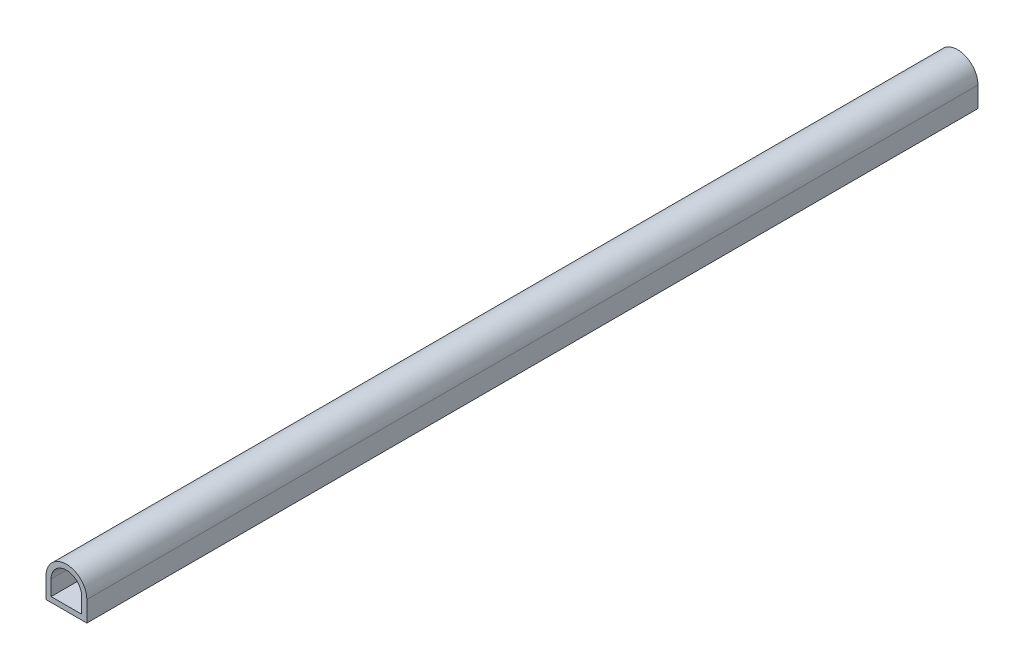
ISO-10303-21;
HEADER;
FILE_DESCRIPTION(('STEP AP214'),'2;1');
FILE_NAME('part.step','',(''),(''),'','','');
FILE_SCHEMA(('AUTOMOTIVE_DESIGN { 1 0 10303 214 1 1 1 1 }'));
ENDSEC;
DATA;
#1=APPLICATION_CONTEXT('core data for automotive mechanical design processes');
#2=APPLICATION_PROTOCOL_DEFINITION('international standard','automotive_design',2000,#1);
#3=PRODUCT_CONTEXT('',#1,'mechanical');
#4=PRODUCT('Part','Part','',(#3));
#5=PRODUCT_RELATED_PRODUCT_CATEGORY('part','',(#4));
#6=PRODUCT_DEFINITION_FORMATION('','',#4);
#7=PRODUCT_DEFINITION_CONTEXT('part definition',#1,'design');
#8=PRODUCT_DEFINITION('design','',#6,#7);
#9=PRODUCT_DEFINITION_SHAPE('','',#8);
#10=(LENGTH_UNIT() NAMED_UNIT(*) SI_UNIT(.MILLI.,.METRE.));
#11=(NAMED_UNIT(*) PLANE_ANGLE_UNIT() SI_UNIT($,.RADIAN.));
#12=(NAMED_UNIT(*) SI_UNIT($,.STERADIAN.) SOLID_ANGLE_UNIT());
#13=UNCERTAINTY_MEASURE_WITH_UNIT(LENGTH_MEASURE(1.E-05),#10,'distance_accuracy_value','');
#14=(GEOMETRIC_REPRESENTATION_CONTEXT(3) GLOBAL_UNCERTAINTY_ASSIGNED_CONTEXT((#13)) GLOBAL_UNIT_ASSIGNED_CONTEXT((#10,
#11,#12)) REPRESENTATION_CONTEXT('',''));
#15=CARTESIAN_POINT('',(0.,0.,0.));
#16=DIRECTION('',(0.,0.,1.));
#17=DIRECTION('',(1.,0.,0.));
#18=AXIS2_PLACEMENT_3D('',#15,#16,#17);
#19=CARTESIAN_POINT('',(0.,0.,131.));
#20=DIRECTION('',(0.,0.,1.));
#21=DIRECTION('',(1.,0.,0.));
#22=AXIS2_PLACEMENT_3D('',#19,#20,#21);
#23=PLANE('',#22);
#24=DIRECTION('',(0.,-1.,0.));
#25=VECTOR('',#24,1.);
#26=CARTESIAN_POINT('',(-3.,-3.,131.));
#27=LINE('',#26,#25);
#28=CARTESIAN_POINT('',(-3.,0.,131.));
#29=VERTEX_POINT('',#28);
#30=CARTESIAN_POINT('',(-3.,-3.,131.));
#31=VERTEX_POINT('',#30);
#32=EDGE_CURVE('E137',#29,#31,#27,.T.);
#33=ORIENTED_EDGE('',*,*,#32,.T.);
#34=DIRECTION('',(1.,0.,0.));
#35=VECTOR('',#34,1.);
#36=CARTESIAN_POINT('',(-3.,-3.,131.));
#37=LINE('',#36,#35);
#38=CARTESIAN_POINT('',(3.,-3.,131.));
#39=VERTEX_POINT('',#38);
#40=EDGE_CURVE('E140',#31,#39,#37,.T.);
#41=ORIENTED_EDGE('',*,*,#40,.T.);
#42=DIRECTION('',(0.,1.,0.));
#43=VECTOR('',#42,1.);
#44=CARTESIAN_POINT('',(3.,-3.,131.));
#45=LINE('',#44,#43);
#46=CARTESIAN_POINT('',(3.,0.,131.));
#47=VERTEX_POINT('',#46);
#48=EDGE_CURVE('E143',#39,#47,#45,.T.);
#49=ORIENTED_EDGE('',*,*,#48,.T.);
#50=CARTESIAN_POINT('',(0.,0.,131.));
#51=DIRECTION('',(0.,0.,1.));
#52=DIRECTION('',(1.,0.,0.));
#53=AXIS2_PLACEMENT_3D('',#50,#51,#52);
#54=CIRCLE('',#53,3.);
#55=EDGE_CURVE('E145',#47,#29,#54,.T.);
#56=ORIENTED_EDGE('',*,*,#55,.T.);
#57=EDGE_LOOP('',(#33,#41,#49,#56));
#58=FACE_BOUND('',#57,.T.);
#59=DIRECTION('',(1.,0.,0.));
#60=VECTOR('',#59,1.);
#61=CARTESIAN_POINT('',(-2.25,-2.25,131.));
#62=LINE('',#61,#60);
#63=CARTESIAN_POINT('',(-2.25,-2.25,131.));
#64=VERTEX_POINT('',#63);
#65=CARTESIAN_POINT('',(2.25,-2.25,131.));
#66=VERTEX_POINT('',#65);
#67=EDGE_CURVE('E109',#64,#66,#62,.T.);
#68=ORIENTED_EDGE('',*,*,#67,.F.);
#69=DIRECTION('',(0.,-1.,0.));
#70=VECTOR('',#69,1.);
#71=CARTESIAN_POINT('',(-2.25,-2.25,131.));
#72=LINE('',#71,#70);
#73=CARTESIAN_POINT('',(-2.25,0.,131.));
#74=VERTEX_POINT('',#73);
#75=EDGE_CURVE('E101',#74,#64,#72,.T.);
#76=ORIENTED_EDGE('',*,*,#75,.F.);
#77=CARTESIAN_POINT('',(0.,0.,131.));
#78=DIRECTION('',(0.,0.,1.));
#79=DIRECTION('',(1.,0.,0.));
#80=AXIS2_PLACEMENT_3D('',#77,#78,#79);
#81=CIRCLE('',#80,2.25);
#82=CARTESIAN_POINT('',(2.25,0.,131.));
#83=VERTEX_POINT('',#82);
#84=EDGE_CURVE('E123',#83,#74,#81,.T.);
#85=ORIENTED_EDGE('',*,*,#84,.F.);
#86=DIRECTION('',(0.,1.,0.));
#87=VECTOR('',#86,1.);
#88=CARTESIAN_POINT('',(2.25,-2.25,131.));
#89=LINE('',#88,#87);
#90=EDGE_CURVE('E121',#66,#83,#89,.T.);
#91=ORIENTED_EDGE('',*,*,#90,.F.);
#92=EDGE_LOOP('',(#68,#76,#85,#91));
#93=FACE_BOUND('',#92,.T.);
#94=ADVANCED_FACE('F36',(#58,#93),#23,.T.);
#95=CARTESIAN_POINT('',(0.,0.,0.));
#96=DIRECTION('',(0.,0.,1.));
#97=DIRECTION('',(1.,0.,0.));
#98=AXIS2_PLACEMENT_3D('',#95,#96,#97);
#99=PLANE('',#98);
#100=DIRECTION('',(0.,-1.,0.));
#101=VECTOR('',#100,1.);
#102=CARTESIAN_POINT('',(-3.,-3.,0.));
#103=LINE('',#102,#101);
#104=CARTESIAN_POINT('',(-3.,0.,0.));
#105=VERTEX_POINT('',#104);
#106=CARTESIAN_POINT('',(-3.,-3.,0.));
#107=VERTEX_POINT('',#106);
#108=EDGE_CURVE('E117',#105,#107,#103,.T.);
#109=ORIENTED_EDGE('',*,*,#108,.F.);
#110=CARTESIAN_POINT('',(0.,0.,0.));
#111=DIRECTION('',(0.,0.,1.));
#112=DIRECTION('',(1.,0.,0.));
#113=AXIS2_PLACEMENT_3D('',#110,#111,#112);
#114=CIRCLE('',#113,3.);
#115=CARTESIAN_POINT('',(3.,0.,0.));
#116=VERTEX_POINT('',#115);
#117=EDGE_CURVE('E141',#116,#105,#114,.T.);
#118=ORIENTED_EDGE('',*,*,#117,.F.);
#119=DIRECTION('',(0.,1.,0.));
#120=VECTOR('',#119,1.);
#121=CARTESIAN_POINT('',(3.,-3.,0.));
#122=LINE('',#121,#120);
#123=CARTESIAN_POINT('',(3.,-3.,0.));
#124=VERTEX_POINT('',#123);
#125=EDGE_CURVE('E152',#124,#116,#122,.T.);
#126=ORIENTED_EDGE('',*,*,#125,.F.);
#127=DIRECTION('',(1.,0.,0.));
#128=VECTOR('',#127,1.);
#129=CARTESIAN_POINT('',(-3.,-3.,0.));
#130=LINE('',#129,#128);
#131=EDGE_CURVE('E150',#107,#124,#130,.T.);
#132=ORIENTED_EDGE('',*,*,#131,.F.);
#133=EDGE_LOOP('',(#109,#118,#126,#132));
#134=FACE_BOUND('',#133,.T.);
#135=DIRECTION('',(0.,-1.,0.));
#136=VECTOR('',#135,1.);
#137=CARTESIAN_POINT('',(-2.25,-2.25,0.));
#138=LINE('',#137,#136);
#139=CARTESIAN_POINT('',(-2.25,0.,0.));
#140=VERTEX_POINT('',#139);
#141=CARTESIAN_POINT('',(-2.25,-2.25,0.));
#142=VERTEX_POINT('',#141);
#143=EDGE_CURVE('E59',#140,#142,#138,.T.);
#144=ORIENTED_EDGE('',*,*,#143,.T.);
#145=DIRECTION('',(1.,0.,0.));
#146=VECTOR('',#145,1.);
#147=CARTESIAN_POINT('',(-2.25,-2.25,0.));
#148=LINE('',#147,#146);
#149=CARTESIAN_POINT('',(2.25,-2.25,0.));
#150=VERTEX_POINT('',#149);
#151=EDGE_CURVE('E116',#142,#150,#148,.T.);
#152=ORIENTED_EDGE('',*,*,#151,.T.);
#153=DIRECTION('',(0.,1.,0.));
#154=VECTOR('',#153,1.);
#155=CARTESIAN_POINT('',(2.25,-2.25,0.));
#156=LINE('',#155,#154);
#157=CARTESIAN_POINT('',(2.25,0.,0.));
#158=VERTEX_POINT('',#157);
#159=EDGE_CURVE('E129',#150,#158,#156,.T.);
#160=ORIENTED_EDGE('',*,*,#159,.T.);
#161=CARTESIAN_POINT('',(0.,0.,0.));
#162=DIRECTION('',(0.,0.,1.));
#163=DIRECTION('',(1.,0.,0.));
#164=AXIS2_PLACEMENT_3D('',#161,#162,#163);
#165=CIRCLE('',#164,2.25);
#166=EDGE_CURVE('E110',#158,#140,#165,.T.);
#167=ORIENTED_EDGE('',*,*,#166,.T.);
#168=EDGE_LOOP('',(#144,#152,#160,#167));
#169=FACE_BOUND('',#168,.T.);
#170=ADVANCED_FACE('F170',(#134,#169),#99,.F.);
#171=CARTESIAN_POINT('',(-3.,-3.,131.));
#172=DIRECTION('',(1.,0.,0.));
#173=DIRECTION('',(0.,0.,-1.));
#174=AXIS2_PLACEMENT_3D('',#171,#172,#173);
#175=PLANE('',#174);
#176=ORIENTED_EDGE('',*,*,#108,.T.);
#177=DIRECTION('',(0.,0.,-1.));
#178=VECTOR('',#177,1.);
#179=CARTESIAN_POINT('',(-3.,-3.,131.));
#180=LINE('',#179,#178);
#181=EDGE_CURVE('E11',#31,#107,#180,.T.);
#182=ORIENTED_EDGE('',*,*,#181,.F.);
#183=ORIENTED_EDGE('',*,*,#32,.F.);
#184=DIRECTION('',(0.,0.,-1.));
#185=VECTOR('',#184,1.);
#186=CARTESIAN_POINT('',(-3.,0.,131.));
#187=LINE('',#186,#185);
#188=EDGE_CURVE('E147',#29,#105,#187,.T.);
#189=ORIENTED_EDGE('',*,*,#188,.T.);
#190=EDGE_LOOP('',(#176,#182,#183,#189));
#191=FACE_BOUND('',#190,.T.);
#192=ADVANCED_FACE('F38',(#191),#175,.F.);
#193=CARTESIAN_POINT('',(-3.,-3.,131.));
#194=DIRECTION('',(0.,1.,0.));
#195=DIRECTION('',(0.,0.,1.));
#196=AXIS2_PLACEMENT_3D('',#193,#194,#195);
#197=PLANE('',#196);
#198=ORIENTED_EDGE('',*,*,#131,.T.);
#199=DIRECTION('',(0.,0.,-1.));
#200=VECTOR('',#199,1.);
#201=CARTESIAN_POINT('',(3.,-3.,131.));
#202=LINE('',#201,#200);
#203=EDGE_CURVE('E44',#39,#124,#202,.T.);
#204=ORIENTED_EDGE('',*,*,#203,.F.);
#205=ORIENTED_EDGE('',*,*,#40,.F.);
#206=ORIENTED_EDGE('',*,*,#181,.T.);
#207=EDGE_LOOP('',(#198,#204,#205,#206));
#208=FACE_BOUND('',#207,.T.);
#209=ADVANCED_FACE('F180',(#208),#197,.F.);
#210=CARTESIAN_POINT('',(3.,-3.,131.));
#211=DIRECTION('',(-1.,0.,0.));
#212=DIRECTION('',(0.,0.,1.));
#213=AXIS2_PLACEMENT_3D('',#210,#211,#212);
#214=PLANE('',#213);
#215=ORIENTED_EDGE('',*,*,#125,.T.);
#216=DIRECTION('',(0.,0.,-1.));
#217=VECTOR('',#216,1.);
#218=CARTESIAN_POINT('',(3.,0.,131.));
#219=LINE('',#218,#217);
#220=EDGE_CURVE('E157',#47,#116,#219,.T.);
#221=ORIENTED_EDGE('',*,*,#220,.F.);
#222=ORIENTED_EDGE('',*,*,#48,.F.);
#223=ORIENTED_EDGE('',*,*,#203,.T.);
#224=EDGE_LOOP('',(#215,#221,#222,#223));
#225=FACE_BOUND('',#224,.T.);
#226=ADVANCED_FACE('F164',(#225),#214,.F.);
#227=CARTESIAN_POINT('',(0.,0.,131.));
#228=DIRECTION('',(0.,0.,-1.));
#229=DIRECTION('',(-1.,0.,0.));
#230=AXIS2_PLACEMENT_3D('',#227,#228,#229);
#231=CYLINDRICAL_SURFACE('',#230,3.);
#232=ORIENTED_EDGE('',*,*,#117,.T.);
#233=ORIENTED_EDGE('',*,*,#188,.F.);
#234=ORIENTED_EDGE('',*,*,#55,.F.);
#235=ORIENTED_EDGE('',*,*,#220,.T.);
#236=EDGE_LOOP('',(#232,#233,#234,#235));
#237=FACE_BOUND('',#236,.T.);
#238=ADVANCED_FACE('F174',(#237),#231,.T.);
#239=CARTESIAN_POINT('',(-2.25,-2.25,131.));
#240=DIRECTION('',(1.,0.,0.));
#241=DIRECTION('',(0.,0.,-1.));
#242=AXIS2_PLACEMENT_3D('',#239,#240,#241);
#243=PLANE('',#242);
#244=ORIENTED_EDGE('',*,*,#143,.F.);
#245=DIRECTION('',(0.,0.,-1.));
#246=VECTOR('',#245,1.);
#247=CARTESIAN_POINT('',(-2.25,0.,131.));
#248=LINE('',#247,#246);
#249=EDGE_CURVE('E105',#74,#140,#248,.T.);
#250=ORIENTED_EDGE('',*,*,#249,.F.);
#251=ORIENTED_EDGE('',*,*,#75,.T.);
#252=DIRECTION('',(0.,0.,-1.));
#253=VECTOR('',#252,1.);
#254=CARTESIAN_POINT('',(-2.25,-2.25,131.));
#255=LINE('',#254,#253);
#256=EDGE_CURVE('E104',#64,#142,#255,.T.);
#257=ORIENTED_EDGE('',*,*,#256,.T.);
#258=EDGE_LOOP('',(#244,#250,#251,#257));
#259=FACE_BOUND('',#258,.T.);
#260=ADVANCED_FACE('F103',(#259),#243,.T.);
#261=CARTESIAN_POINT('',(-2.25,-2.25,131.));
#262=DIRECTION('',(0.,1.,0.));
#263=DIRECTION('',(0.,0.,1.));
#264=AXIS2_PLACEMENT_3D('',#261,#262,#263);
#265=PLANE('',#264);
#266=ORIENTED_EDGE('',*,*,#151,.F.);
#267=ORIENTED_EDGE('',*,*,#256,.F.);
#268=ORIENTED_EDGE('',*,*,#67,.T.);
#269=DIRECTION('',(0.,0.,-1.));
#270=VECTOR('',#269,1.);
#271=CARTESIAN_POINT('',(2.25,-2.25,131.));
#272=LINE('',#271,#270);
#273=EDGE_CURVE('E118',#66,#150,#272,.T.);
#274=ORIENTED_EDGE('',*,*,#273,.T.);
#275=EDGE_LOOP('',(#266,#267,#268,#274));
#276=FACE_BOUND('',#275,.T.);
#277=ADVANCED_FACE('F113',(#276),#265,.T.);
#278=CARTESIAN_POINT('',(2.25,-2.25,131.));
#279=DIRECTION('',(-1.,0.,0.));
#280=DIRECTION('',(0.,0.,1.));
#281=AXIS2_PLACEMENT_3D('',#278,#279,#280);
#282=PLANE('',#281);
#283=ORIENTED_EDGE('',*,*,#159,.F.);
#284=ORIENTED_EDGE('',*,*,#273,.F.);
#285=ORIENTED_EDGE('',*,*,#90,.T.);
#286=DIRECTION('',(0.,0.,-1.));
#287=VECTOR('',#286,1.);
#288=CARTESIAN_POINT('',(2.25,0.,131.));
#289=LINE('',#288,#287);
#290=EDGE_CURVE('E51',#83,#158,#289,.T.);
#291=ORIENTED_EDGE('',*,*,#290,.T.);
#292=EDGE_LOOP('',(#283,#284,#285,#291));
#293=FACE_BOUND('',#292,.T.);
#294=ADVANCED_FACE('F203',(#293),#282,.T.);
#295=CARTESIAN_POINT('',(0.,0.,131.));
#296=DIRECTION('',(0.,0.,-1.));
#297=DIRECTION('',(-1.,0.,0.));
#298=AXIS2_PLACEMENT_3D('',#295,#296,#297);
#299=CYLINDRICAL_SURFACE('',#298,2.25);
#300=ORIENTED_EDGE('',*,*,#166,.F.);
#301=ORIENTED_EDGE('',*,*,#290,.F.);
#302=ORIENTED_EDGE('',*,*,#84,.T.);
#303=ORIENTED_EDGE('',*,*,#249,.T.);
#304=EDGE_LOOP('',(#300,#301,#302,#303));
#305=FACE_BOUND('',#304,.T.);
#306=ADVANCED_FACE('F207',(#305),#299,.F.);
#307=CLOSED_SHELL('',(#94,#170,#192,#209,#226,#238,#260,#277,#294,#306));
#308=MANIFOLD_SOLID_BREP('B2',#307);
#309=ADVANCED_BREP_SHAPE_REPRESENTATION('',(#18,#308),#14);
#310=SHAPE_DEFINITION_REPRESENTATION(#9,#309);
ENDSEC;
END-ISO-10303-21;
